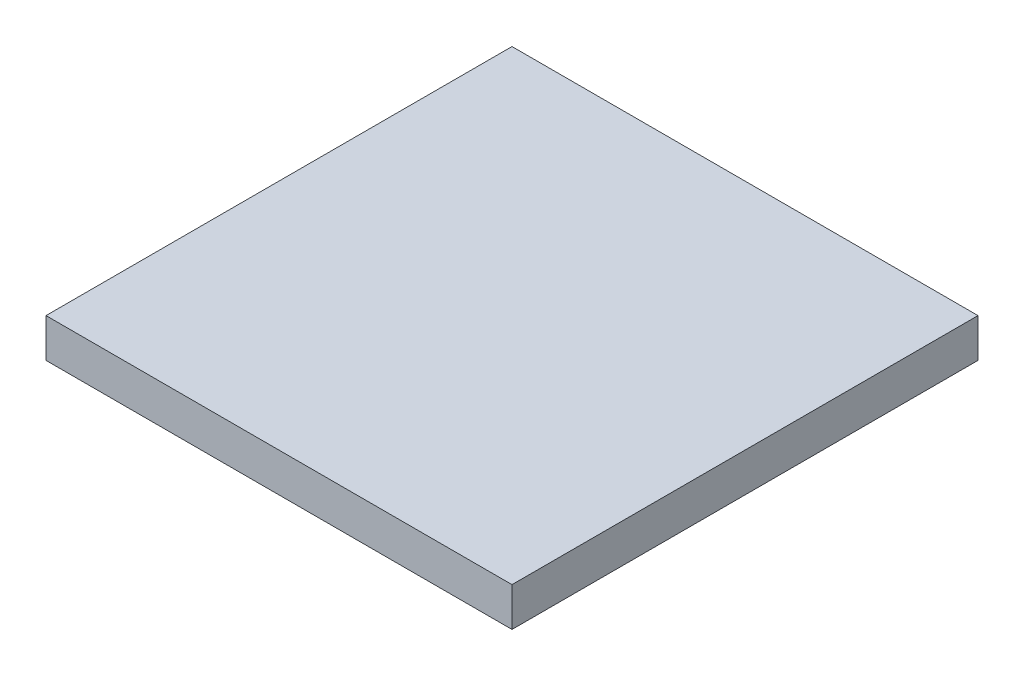
ISO-10303-21;
HEADER;
FILE_DESCRIPTION(('STEP AP214'),'2;1');
FILE_NAME('part.step','',(''),(''),'','','');
FILE_SCHEMA(('AUTOMOTIVE_DESIGN { 1 0 10303 214 1 1 1 1 }'));
ENDSEC;
DATA;
#1=APPLICATION_CONTEXT('core data for automotive mechanical design processes');
#2=APPLICATION_PROTOCOL_DEFINITION('international standard','automotive_design',2000,#1);
#3=PRODUCT_CONTEXT('',#1,'mechanical');
#4=PRODUCT('Part','Part','',(#3));
#5=PRODUCT_RELATED_PRODUCT_CATEGORY('part','',(#4));
#6=PRODUCT_DEFINITION_FORMATION('','',#4);
#7=PRODUCT_DEFINITION_CONTEXT('part definition',#1,'design');
#8=PRODUCT_DEFINITION('design','',#6,#7);
#9=PRODUCT_DEFINITION_SHAPE('','',#8);
#10=(LENGTH_UNIT() NAMED_UNIT(*) SI_UNIT(.MILLI.,.METRE.));
#11=(NAMED_UNIT(*) PLANE_ANGLE_UNIT() SI_UNIT($,.RADIAN.));
#12=(NAMED_UNIT(*) SI_UNIT($,.STERADIAN.) SOLID_ANGLE_UNIT());
#13=UNCERTAINTY_MEASURE_WITH_UNIT(LENGTH_MEASURE(1.E-05),#10,'distance_accuracy_value','');
#14=(GEOMETRIC_REPRESENTATION_CONTEXT(3) GLOBAL_UNCERTAINTY_ASSIGNED_CONTEXT((#13)) GLOBAL_UNIT_ASSIGNED_CONTEXT((#10,
#11,#12)) REPRESENTATION_CONTEXT('',''));
#15=CARTESIAN_POINT('',(0.,0.,0.));
#16=DIRECTION('',(0.,0.,1.));
#17=DIRECTION('',(1.,0.,0.));
#18=AXIS2_PLACEMENT_3D('',#15,#16,#17);
#19=CARTESIAN_POINT('',(0.6,0.1,-0.6));
#20=DIRECTION('',(-1.,0.,0.));
#21=DIRECTION('',(0.,0.,1.));
#22=AXIS2_PLACEMENT_3D('',#19,#20,#21);
#23=PLANE('',#22);
#24=DIRECTION('',(0.,0.,-1.));
#25=VECTOR('',#24,1.);
#26=CARTESIAN_POINT('',(0.6,0.,-0.6));
#27=LINE('',#26,#25);
#28=CARTESIAN_POINT('',(0.6,0.,0.6));
#29=VERTEX_POINT('',#28);
#30=CARTESIAN_POINT('',(0.6,0.,-0.6));
#31=VERTEX_POINT('',#30);
#32=EDGE_CURVE('E97',#29,#31,#27,.T.);
#33=ORIENTED_EDGE('',*,*,#32,.T.);
#34=DIRECTION('',(0.,-1.,0.));
#35=VECTOR('',#34,1.);
#36=CARTESIAN_POINT('',(0.6,0.1,-0.6));
#37=LINE('',#36,#35);
#38=CARTESIAN_POINT('',(0.6,0.1,-0.6));
#39=VERTEX_POINT('',#38);
#40=EDGE_CURVE('E11',#39,#31,#37,.T.);
#41=ORIENTED_EDGE('',*,*,#40,.F.);
#42=DIRECTION('',(0.,0.,-1.));
#43=VECTOR('',#42,1.);
#44=CARTESIAN_POINT('',(0.6,0.1,-0.6));
#45=LINE('',#44,#43);
#46=CARTESIAN_POINT('',(0.6,0.1,0.6));
#47=VERTEX_POINT('',#46);
#48=EDGE_CURVE('E85',#47,#39,#45,.T.);
#49=ORIENTED_EDGE('',*,*,#48,.F.);
#50=DIRECTION('',(0.,-1.,0.));
#51=VECTOR('',#50,1.);
#52=CARTESIAN_POINT('',(0.6,0.1,0.6));
#53=LINE('',#52,#51);
#54=EDGE_CURVE('E93',#47,#29,#53,.T.);
#55=ORIENTED_EDGE('',*,*,#54,.T.);
#56=EDGE_LOOP('',(#33,#41,#49,#55));
#57=FACE_BOUND('',#56,.T.);
#58=ADVANCED_FACE('F34',(#57),#23,.F.);
#59=CARTESIAN_POINT('',(-0.6,0.1,-0.6));
#60=DIRECTION('',(0.,0.,1.));
#61=DIRECTION('',(1.,0.,0.));
#62=AXIS2_PLACEMENT_3D('',#59,#60,#61);
#63=PLANE('',#62);
#64=DIRECTION('',(-1.,0.,0.));
#65=VECTOR('',#64,1.);
#66=CARTESIAN_POINT('',(-0.6,0.,-0.6));
#67=LINE('',#66,#65);
#68=CARTESIAN_POINT('',(-0.6,0.,-0.6));
#69=VERTEX_POINT('',#68);
#70=EDGE_CURVE('E89',#31,#69,#67,.T.);
#71=ORIENTED_EDGE('',*,*,#70,.T.);
#72=DIRECTION('',(0.,-1.,0.));
#73=VECTOR('',#72,1.);
#74=CARTESIAN_POINT('',(-0.6,0.1,-0.6));
#75=LINE('',#74,#73);
#76=CARTESIAN_POINT('',(-0.6,0.1,-0.6));
#77=VERTEX_POINT('',#76);
#78=EDGE_CURVE('E42',#77,#69,#75,.T.);
#79=ORIENTED_EDGE('',*,*,#78,.F.);
#80=DIRECTION('',(-1.,0.,0.));
#81=VECTOR('',#80,1.);
#82=CARTESIAN_POINT('',(-0.6,0.1,-0.6));
#83=LINE('',#82,#81);
#84=EDGE_CURVE('E80',#39,#77,#83,.T.);
#85=ORIENTED_EDGE('',*,*,#84,.F.);
#86=ORIENTED_EDGE('',*,*,#40,.T.);
#87=EDGE_LOOP('',(#71,#79,#85,#86));
#88=FACE_BOUND('',#87,.T.);
#89=ADVANCED_FACE('F88',(#88),#63,.F.);
#90=CARTESIAN_POINT('',(-0.6,0.1,-0.6));
#91=DIRECTION('',(1.,0.,0.));
#92=DIRECTION('',(0.,0.,-1.));
#93=AXIS2_PLACEMENT_3D('',#90,#91,#92);
#94=PLANE('',#93);
#95=DIRECTION('',(0.,0.,1.));
#96=VECTOR('',#95,1.);
#97=CARTESIAN_POINT('',(-0.6,0.,-0.6));
#98=LINE('',#97,#96);
#99=CARTESIAN_POINT('',(-0.6,0.,0.6));
#100=VERTEX_POINT('',#99);
#101=EDGE_CURVE('E67',#69,#100,#98,.T.);
#102=ORIENTED_EDGE('',*,*,#101,.T.);
#103=DIRECTION('',(0.,-1.,0.));
#104=VECTOR('',#103,1.);
#105=CARTESIAN_POINT('',(-0.6,0.1,0.6));
#106=LINE('',#105,#104);
#107=CARTESIAN_POINT('',(-0.6,0.1,0.6));
#108=VERTEX_POINT('',#107);
#109=EDGE_CURVE('E90',#108,#100,#106,.T.);
#110=ORIENTED_EDGE('',*,*,#109,.F.);
#111=DIRECTION('',(0.,0.,1.));
#112=VECTOR('',#111,1.);
#113=CARTESIAN_POINT('',(-0.6,0.1,-0.6));
#114=LINE('',#113,#112);
#115=EDGE_CURVE('E83',#77,#108,#114,.T.);
#116=ORIENTED_EDGE('',*,*,#115,.F.);
#117=ORIENTED_EDGE('',*,*,#78,.T.);
#118=EDGE_LOOP('',(#102,#110,#116,#117));
#119=FACE_BOUND('',#118,.T.);
#120=ADVANCED_FACE('F91',(#119),#94,.F.);
#121=CARTESIAN_POINT('',(-0.6,0.1,0.6));
#122=DIRECTION('',(0.,0.,-1.));
#123=DIRECTION('',(-1.,0.,0.));
#124=AXIS2_PLACEMENT_3D('',#121,#122,#123);
#125=PLANE('',#124);
#126=DIRECTION('',(1.,0.,0.));
#127=VECTOR('',#126,1.);
#128=CARTESIAN_POINT('',(-0.6,0.,0.6));
#129=LINE('',#128,#127);
#130=EDGE_CURVE('E73',#100,#29,#129,.T.);
#131=ORIENTED_EDGE('',*,*,#130,.T.);
#132=ORIENTED_EDGE('',*,*,#54,.F.);
#133=DIRECTION('',(1.,0.,0.));
#134=VECTOR('',#133,1.);
#135=CARTESIAN_POINT('',(-0.6,0.1,0.6));
#136=LINE('',#135,#134);
#137=EDGE_CURVE('E50',#108,#47,#136,.T.);
#138=ORIENTED_EDGE('',*,*,#137,.F.);
#139=ORIENTED_EDGE('',*,*,#109,.T.);
#140=EDGE_LOOP('',(#131,#132,#138,#139));
#141=FACE_BOUND('',#140,.T.);
#142=ADVANCED_FACE('F104',(#141),#125,.F.);
#143=CARTESIAN_POINT('',(0.,0.1,0.));
#144=DIRECTION('',(0.,1.,0.));
#145=DIRECTION('',(0.,0.,1.));
#146=AXIS2_PLACEMENT_3D('',#143,#144,#145);
#147=PLANE('',#146);
#148=ORIENTED_EDGE('',*,*,#48,.T.);
#149=ORIENTED_EDGE('',*,*,#84,.T.);
#150=ORIENTED_EDGE('',*,*,#115,.T.);
#151=ORIENTED_EDGE('',*,*,#137,.T.);
#152=EDGE_LOOP('',(#148,#149,#150,#151));
#153=FACE_BOUND('',#152,.T.);
#154=ADVANCED_FACE('F81',(#153),#147,.T.);
#155=CARTESIAN_POINT('',(0.,0.,0.));
#156=DIRECTION('',(0.,1.,0.));
#157=DIRECTION('',(0.,0.,1.));
#158=AXIS2_PLACEMENT_3D('',#155,#156,#157);
#159=PLANE('',#158);
#160=ORIENTED_EDGE('',*,*,#32,.F.);
#161=ORIENTED_EDGE('',*,*,#130,.F.);
#162=ORIENTED_EDGE('',*,*,#101,.F.);
#163=ORIENTED_EDGE('',*,*,#70,.F.);
#164=EDGE_LOOP('',(#160,#161,#162,#163));
#165=FACE_BOUND('',#164,.T.);
#166=ADVANCED_FACE('F107',(#165),#159,.F.);
#167=CLOSED_SHELL('',(#58,#89,#120,#142,#154,#166));
#168=MANIFOLD_SOLID_BREP('B2',#167);
#169=ADVANCED_BREP_SHAPE_REPRESENTATION('',(#18,#168),#14);
#170=SHAPE_DEFINITION_REPRESENTATION(#9,#169);
ENDSEC;
END-ISO-10303-21;
